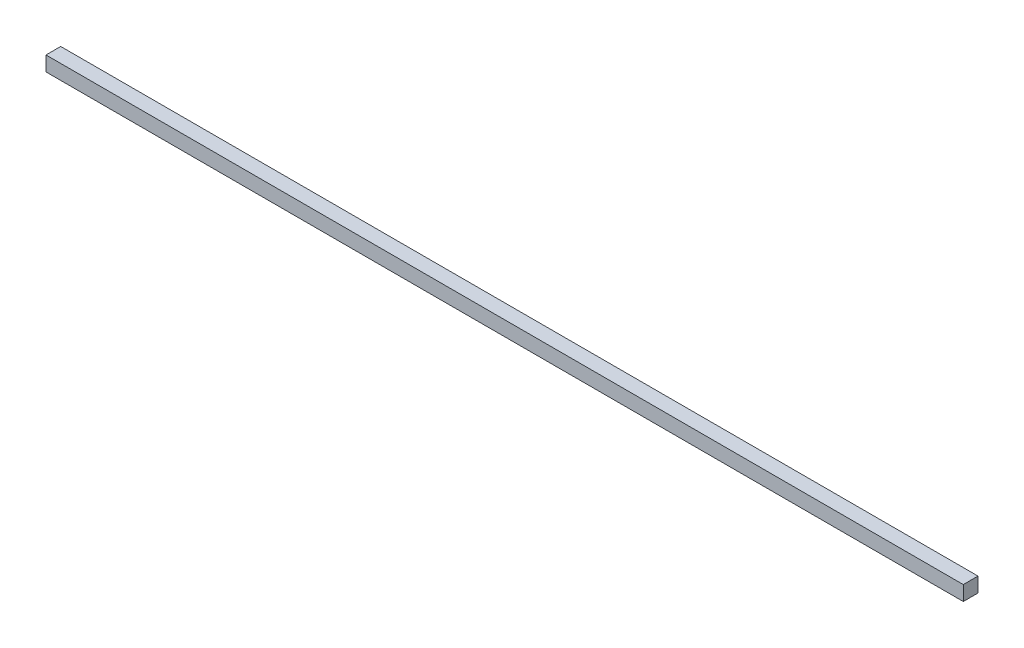
ISO-10303-21;
HEADER;
FILE_DESCRIPTION(('STEP AP214'),'2;1');
FILE_NAME('part.step','',(''),(''),'','','');
FILE_SCHEMA(('AUTOMOTIVE_DESIGN { 1 0 10303 214 1 1 1 1 }'));
ENDSEC;
DATA;
#1=APPLICATION_CONTEXT('core data for automotive mechanical design processes');
#2=APPLICATION_PROTOCOL_DEFINITION('international standard','automotive_design',2000,#1);
#3=PRODUCT_CONTEXT('',#1,'mechanical');
#4=PRODUCT('Part','Part','',(#3));
#5=PRODUCT_RELATED_PRODUCT_CATEGORY('part','',(#4));
#6=PRODUCT_DEFINITION_FORMATION('','',#4);
#7=PRODUCT_DEFINITION_CONTEXT('part definition',#1,'design');
#8=PRODUCT_DEFINITION('design','',#6,#7);
#9=PRODUCT_DEFINITION_SHAPE('','',#8);
#10=(LENGTH_UNIT() NAMED_UNIT(*) SI_UNIT(.MILLI.,.METRE.));
#11=(NAMED_UNIT(*) PLANE_ANGLE_UNIT() SI_UNIT($,.RADIAN.));
#12=(NAMED_UNIT(*) SI_UNIT($,.STERADIAN.) SOLID_ANGLE_UNIT());
#13=UNCERTAINTY_MEASURE_WITH_UNIT(LENGTH_MEASURE(1.E-05),#10,'distance_accuracy_value','');
#14=(GEOMETRIC_REPRESENTATION_CONTEXT(3) GLOBAL_UNCERTAINTY_ASSIGNED_CONTEXT((#13)) GLOBAL_UNIT_ASSIGNED_CONTEXT((#10,
#11,#12)) REPRESENTATION_CONTEXT('',''));
#15=CARTESIAN_POINT('',(0.,0.,0.));
#16=DIRECTION('',(0.,0.,1.));
#17=DIRECTION('',(1.,0.,0.));
#18=AXIS2_PLACEMENT_3D('',#15,#16,#17);
#19=CARTESIAN_POINT('',(0.,3.,0.));
#20=DIRECTION('',(1.,0.,0.));
#21=DIRECTION('',(0.,0.,-1.));
#22=AXIS2_PLACEMENT_3D('',#19,#20,#21);
#23=PLANE('',#22);
#24=DIRECTION('',(0.,0.,1.));
#25=VECTOR('',#24,1.);
#26=CARTESIAN_POINT('',(0.,0.,0.));
#27=LINE('',#26,#25);
#28=CARTESIAN_POINT('',(0.,0.,-3.));
#29=VERTEX_POINT('',#28);
#30=CARTESIAN_POINT('',(0.,0.,0.));
#31=VERTEX_POINT('',#30);
#32=EDGE_CURVE('E96',#29,#31,#27,.T.);
#33=ORIENTED_EDGE('',*,*,#32,.T.);
#34=DIRECTION('',(0.,-1.,0.));
#35=VECTOR('',#34,1.);
#36=CARTESIAN_POINT('',(0.,3.,0.));
#37=LINE('',#36,#35);
#38=CARTESIAN_POINT('',(0.,3.,0.));
#39=VERTEX_POINT('',#38);
#40=EDGE_CURVE('E11',#39,#31,#37,.T.);
#41=ORIENTED_EDGE('',*,*,#40,.F.);
#42=DIRECTION('',(0.,0.,1.));
#43=VECTOR('',#42,1.);
#44=CARTESIAN_POINT('',(0.,3.,0.));
#45=LINE('',#44,#43);
#46=CARTESIAN_POINT('',(0.,3.,-3.));
#47=VERTEX_POINT('',#46);
#48=EDGE_CURVE('E84',#47,#39,#45,.T.);
#49=ORIENTED_EDGE('',*,*,#48,.F.);
#50=DIRECTION('',(0.,-1.,0.));
#51=VECTOR('',#50,1.);
#52=CARTESIAN_POINT('',(0.,3.,-3.));
#53=LINE('',#52,#51);
#54=EDGE_CURVE('E92',#47,#29,#53,.T.);
#55=ORIENTED_EDGE('',*,*,#54,.T.);
#56=EDGE_LOOP('',(#33,#41,#49,#55));
#57=FACE_BOUND('',#56,.T.);
#58=ADVANCED_FACE('F33',(#57),#23,.F.);
#59=CARTESIAN_POINT('',(0.,3.,0.));
#60=DIRECTION('',(0.,0.,-1.));
#61=DIRECTION('',(-1.,0.,0.));
#62=AXIS2_PLACEMENT_3D('',#59,#60,#61);
#63=PLANE('',#62);
#64=DIRECTION('',(1.,0.,0.));
#65=VECTOR('',#64,1.);
#66=CARTESIAN_POINT('',(0.,0.,0.));
#67=LINE('',#66,#65);
#68=CARTESIAN_POINT('',(187.,0.,0.));
#69=VERTEX_POINT('',#68);
#70=EDGE_CURVE('E88',#31,#69,#67,.T.);
#71=ORIENTED_EDGE('',*,*,#70,.T.);
#72=DIRECTION('',(0.,-1.,0.));
#73=VECTOR('',#72,1.);
#74=CARTESIAN_POINT('',(187.,3.,0.));
#75=LINE('',#74,#73);
#76=CARTESIAN_POINT('',(187.,3.,0.));
#77=VERTEX_POINT('',#76);
#78=EDGE_CURVE('E41',#77,#69,#75,.T.);
#79=ORIENTED_EDGE('',*,*,#78,.F.);
#80=DIRECTION('',(1.,0.,0.));
#81=VECTOR('',#80,1.);
#82=CARTESIAN_POINT('',(0.,3.,0.));
#83=LINE('',#82,#81);
#84=EDGE_CURVE('E79',#39,#77,#83,.T.);
#85=ORIENTED_EDGE('',*,*,#84,.F.);
#86=ORIENTED_EDGE('',*,*,#40,.T.);
#87=EDGE_LOOP('',(#71,#79,#85,#86));
#88=FACE_BOUND('',#87,.T.);
#89=ADVANCED_FACE('F87',(#88),#63,.F.);
#90=CARTESIAN_POINT('',(187.,3.,0.));
#91=DIRECTION('',(-1.,0.,0.));
#92=DIRECTION('',(0.,0.,1.));
#93=AXIS2_PLACEMENT_3D('',#90,#91,#92);
#94=PLANE('',#93);
#95=DIRECTION('',(0.,0.,-1.));
#96=VECTOR('',#95,1.);
#97=CARTESIAN_POINT('',(187.,0.,0.));
#98=LINE('',#97,#96);
#99=CARTESIAN_POINT('',(187.,0.,-3.));
#100=VERTEX_POINT('',#99);
#101=EDGE_CURVE('E66',#69,#100,#98,.T.);
#102=ORIENTED_EDGE('',*,*,#101,.T.);
#103=DIRECTION('',(0.,-1.,0.));
#104=VECTOR('',#103,1.);
#105=CARTESIAN_POINT('',(187.,3.,-3.));
#106=LINE('',#105,#104);
#107=CARTESIAN_POINT('',(187.,3.,-3.));
#108=VERTEX_POINT('',#107);
#109=EDGE_CURVE('E89',#108,#100,#106,.T.);
#110=ORIENTED_EDGE('',*,*,#109,.F.);
#111=DIRECTION('',(0.,0.,-1.));
#112=VECTOR('',#111,1.);
#113=CARTESIAN_POINT('',(187.,3.,0.));
#114=LINE('',#113,#112);
#115=EDGE_CURVE('E82',#77,#108,#114,.T.);
#116=ORIENTED_EDGE('',*,*,#115,.F.);
#117=ORIENTED_EDGE('',*,*,#78,.T.);
#118=EDGE_LOOP('',(#102,#110,#116,#117));
#119=FACE_BOUND('',#118,.T.);
#120=ADVANCED_FACE('F90',(#119),#94,.F.);
#121=CARTESIAN_POINT('',(0.,3.,-3.));
#122=DIRECTION('',(0.,0.,1.));
#123=DIRECTION('',(1.,0.,0.));
#124=AXIS2_PLACEMENT_3D('',#121,#122,#123);
#125=PLANE('',#124);
#126=DIRECTION('',(-1.,0.,0.));
#127=VECTOR('',#126,1.);
#128=CARTESIAN_POINT('',(0.,0.,-3.));
#129=LINE('',#128,#127);
#130=EDGE_CURVE('E72',#100,#29,#129,.T.);
#131=ORIENTED_EDGE('',*,*,#130,.T.);
#132=ORIENTED_EDGE('',*,*,#54,.F.);
#133=DIRECTION('',(-1.,0.,0.));
#134=VECTOR('',#133,1.);
#135=CARTESIAN_POINT('',(0.,3.,-3.));
#136=LINE('',#135,#134);
#137=EDGE_CURVE('E49',#108,#47,#136,.T.);
#138=ORIENTED_EDGE('',*,*,#137,.F.);
#139=ORIENTED_EDGE('',*,*,#109,.T.);
#140=EDGE_LOOP('',(#131,#132,#138,#139));
#141=FACE_BOUND('',#140,.T.);
#142=ADVANCED_FACE('F103',(#141),#125,.F.);
#143=CARTESIAN_POINT('',(0.,3.,0.));
#144=DIRECTION('',(0.,-1.,0.));
#145=DIRECTION('',(0.,0.,-1.));
#146=AXIS2_PLACEMENT_3D('',#143,#144,#145);
#147=PLANE('',#146);
#148=ORIENTED_EDGE('',*,*,#48,.T.);
#149=ORIENTED_EDGE('',*,*,#84,.T.);
#150=ORIENTED_EDGE('',*,*,#115,.T.);
#151=ORIENTED_EDGE('',*,*,#137,.T.);
#152=EDGE_LOOP('',(#148,#149,#150,#151));
#153=FACE_BOUND('',#152,.T.);
#154=ADVANCED_FACE('F80',(#153),#147,.F.);
#155=CARTESIAN_POINT('',(0.,0.,0.));
#156=DIRECTION('',(0.,-1.,0.));
#157=DIRECTION('',(0.,0.,-1.));
#158=AXIS2_PLACEMENT_3D('',#155,#156,#157);
#159=PLANE('',#158);
#160=ORIENTED_EDGE('',*,*,#32,.F.);
#161=ORIENTED_EDGE('',*,*,#130,.F.);
#162=ORIENTED_EDGE('',*,*,#101,.F.);
#163=ORIENTED_EDGE('',*,*,#70,.F.);
#164=EDGE_LOOP('',(#160,#161,#162,#163));
#165=FACE_BOUND('',#164,.T.);
#166=ADVANCED_FACE('F106',(#165),#159,.T.);
#167=CLOSED_SHELL('',(#58,#89,#120,#142,#154,#166));
#168=MANIFOLD_SOLID_BREP('B2',#167);
#169=ADVANCED_BREP_SHAPE_REPRESENTATION('',(#18,#168),#14);
#170=SHAPE_DEFINITION_REPRESENTATION(#9,#169);
ENDSEC;
END-ISO-10303-21;
